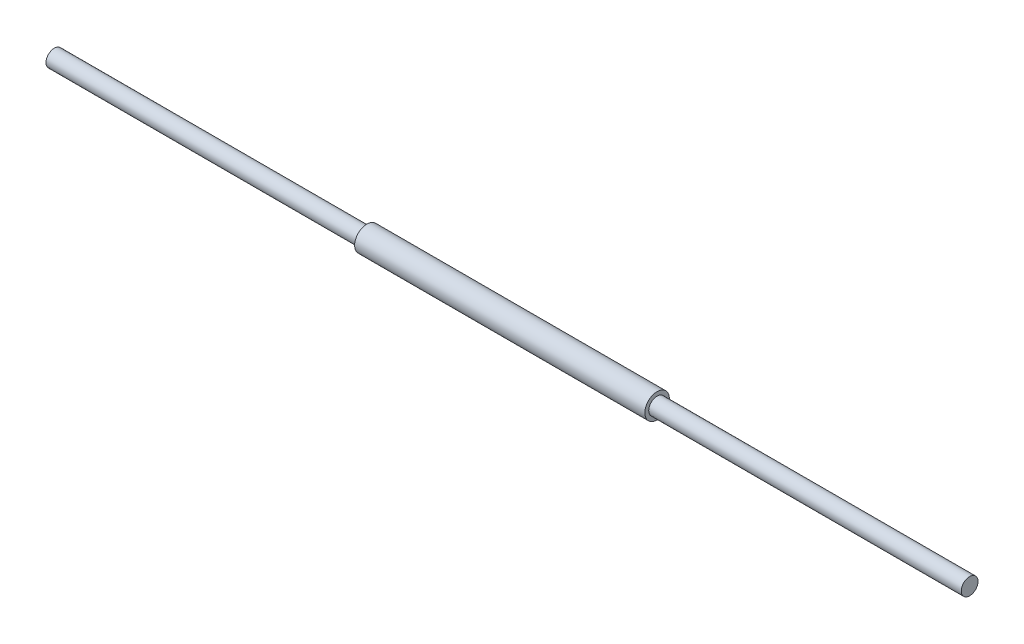
ISO-10303-21;
HEADER;
FILE_DESCRIPTION(('STEP AP214'),'2;1');
FILE_NAME('part.step','',(''),(''),'','','');
FILE_SCHEMA(('AUTOMOTIVE_DESIGN { 1 0 10303 214 1 1 1 1 }'));
ENDSEC;
DATA;
#1=APPLICATION_CONTEXT('core data for automotive mechanical design processes');
#2=APPLICATION_PROTOCOL_DEFINITION('international standard','automotive_design',2000,#1);
#3=PRODUCT_CONTEXT('',#1,'mechanical');
#4=PRODUCT('Part','Part','',(#3));
#5=PRODUCT_RELATED_PRODUCT_CATEGORY('part','',(#4));
#6=PRODUCT_DEFINITION_FORMATION('','',#4);
#7=PRODUCT_DEFINITION_CONTEXT('part definition',#1,'design');
#8=PRODUCT_DEFINITION('design','',#6,#7);
#9=PRODUCT_DEFINITION_SHAPE('','',#8);
#10=(LENGTH_UNIT() NAMED_UNIT(*) SI_UNIT(.MILLI.,.METRE.));
#11=(NAMED_UNIT(*) PLANE_ANGLE_UNIT() SI_UNIT($,.RADIAN.));
#12=(NAMED_UNIT(*) SI_UNIT($,.STERADIAN.) SOLID_ANGLE_UNIT());
#13=UNCERTAINTY_MEASURE_WITH_UNIT(LENGTH_MEASURE(1.E-05),#10,'distance_accuracy_value','');
#14=(GEOMETRIC_REPRESENTATION_CONTEXT(3) GLOBAL_UNCERTAINTY_ASSIGNED_CONTEXT((#13)) GLOBAL_UNIT_ASSIGNED_CONTEXT((#10,
#11,#12)) REPRESENTATION_CONTEXT('',''));
#15=CARTESIAN_POINT('',(0.,0.,0.));
#16=DIRECTION('',(0.,0.,1.));
#17=DIRECTION('',(1.,0.,0.));
#18=AXIS2_PLACEMENT_3D('',#15,#16,#17);
#19=CARTESIAN_POINT('',(-260.35,4.7625,0.));
#20=DIRECTION('',(1.,0.,0.));
#21=DIRECTION('',(0.,1.,0.));
#22=AXIS2_PLACEMENT_3D('',#19,#20,#21);
#23=PLANE('',#22);
#24=CARTESIAN_POINT('',(-260.35,0.,0.));
#25=DIRECTION('',(-1.,0.,0.));
#26=DIRECTION('',(0.,-1.,0.));
#27=AXIS2_PLACEMENT_3D('',#24,#25,#26);
#28=CIRCLE('',#27,4.76250000000003);
#29=CARTESIAN_POINT('',(-260.35,-4.76250000000007,0.));
#30=VERTEX_POINT('',#29);
#31=EDGE_CURVE('E10',#30,#30,#28,.T.);
#32=ORIENTED_EDGE('',*,*,#31,.T.);
#33=EDGE_LOOP('',(#32));
#34=FACE_BOUND('',#33,.T.);
#35=ADVANCED_FACE('F43',(#34),#23,.F.);
#36=CARTESIAN_POINT('',(-260.35,0.,0.));
#37=DIRECTION('',(-1.,0.,0.));
#38=DIRECTION('',(0.,-1.,0.));
#39=AXIS2_PLACEMENT_3D('',#36,#37,#38);
#40=CYLINDRICAL_SURFACE('',#39,4.76250000000002);
#41=ORIENTED_EDGE('',*,*,#31,.F.);
#42=EDGE_LOOP('',(#41));
#43=FACE_BOUND('',#42,.T.);
#44=CARTESIAN_POINT('',(-82.55,0.,0.));
#45=DIRECTION('',(-1.,0.,0.));
#46=DIRECTION('',(0.,-1.,0.));
#47=AXIS2_PLACEMENT_3D('',#44,#45,#46);
#48=CIRCLE('',#47,4.7625);
#49=CARTESIAN_POINT('',(-82.55,-4.7625,0.));
#50=VERTEX_POINT('',#49);
#51=EDGE_CURVE('E50',#50,#50,#48,.T.);
#52=ORIENTED_EDGE('',*,*,#51,.T.);
#53=EDGE_LOOP('',(#52));
#54=FACE_BOUND('',#53,.T.);
#55=ADVANCED_FACE('F87',(#43,#54),#40,.T.);
#56=CARTESIAN_POINT('',(-82.55,4.7625,0.));
#57=DIRECTION('',(1.,0.,0.));
#58=DIRECTION('',(0.,1.,0.));
#59=AXIS2_PLACEMENT_3D('',#56,#57,#58);
#60=PLANE('',#59);
#61=ORIENTED_EDGE('',*,*,#51,.F.);
#62=EDGE_LOOP('',(#61));
#63=FACE_BOUND('',#62,.T.);
#64=CARTESIAN_POINT('',(-82.55,0.,0.));
#65=DIRECTION('',(-1.,0.,0.));
#66=DIRECTION('',(0.,-1.,0.));
#67=AXIS2_PLACEMENT_3D('',#64,#65,#66);
#68=CIRCLE('',#67,6.98499999999996);
#69=CARTESIAN_POINT('',(-82.55,-6.98499999999996,0.));
#70=VERTEX_POINT('',#69);
#71=EDGE_CURVE('E55',#70,#70,#68,.T.);
#72=ORIENTED_EDGE('',*,*,#71,.T.);
#73=EDGE_LOOP('',(#72));
#74=FACE_BOUND('',#73,.T.);
#75=ADVANCED_FACE('F91',(#63,#74),#60,.F.);
#76=CARTESIAN_POINT('',(-260.35,0.,0.));
#77=DIRECTION('',(-1.,0.,0.));
#78=DIRECTION('',(0.,-1.,0.));
#79=AXIS2_PLACEMENT_3D('',#76,#77,#78);
#80=CYLINDRICAL_SURFACE('',#79,6.98499999999994);
#81=ORIENTED_EDGE('',*,*,#71,.F.);
#82=EDGE_LOOP('',(#81));
#83=FACE_BOUND('',#82,.T.);
#84=CARTESIAN_POINT('',(82.55,0.,0.));
#85=DIRECTION('',(-1.,0.,0.));
#86=DIRECTION('',(0.,-1.,0.));
#87=AXIS2_PLACEMENT_3D('',#84,#85,#86);
#88=CIRCLE('',#87,6.98499999999993);
#89=CARTESIAN_POINT('',(82.55,-6.9849999999999,0.));
#90=VERTEX_POINT('',#89);
#91=EDGE_CURVE('E60',#90,#90,#88,.T.);
#92=ORIENTED_EDGE('',*,*,#91,.T.);
#93=EDGE_LOOP('',(#92));
#94=FACE_BOUND('',#93,.T.);
#95=ADVANCED_FACE('F96',(#83,#94),#80,.T.);
#96=CARTESIAN_POINT('',(82.55,6.98499999999996,0.));
#97=DIRECTION('',(-1.,0.,0.));
#98=DIRECTION('',(0.,-1.,0.));
#99=AXIS2_PLACEMENT_3D('',#96,#97,#98);
#100=PLANE('',#99);
#101=ORIENTED_EDGE('',*,*,#91,.F.);
#102=EDGE_LOOP('',(#101));
#103=FACE_BOUND('',#102,.T.);
#104=CARTESIAN_POINT('',(82.55,0.,0.));
#105=DIRECTION('',(-1.,0.,0.));
#106=DIRECTION('',(0.,-1.,0.));
#107=AXIS2_PLACEMENT_3D('',#104,#105,#106);
#108=CIRCLE('',#107,4.76249999999997);
#109=CARTESIAN_POINT('',(82.55,-4.76249999999994,0.));
#110=VERTEX_POINT('',#109);
#111=EDGE_CURVE('E66',#110,#110,#108,.T.);
#112=ORIENTED_EDGE('',*,*,#111,.T.);
#113=EDGE_LOOP('',(#112));
#114=FACE_BOUND('',#113,.T.);
#115=ADVANCED_FACE('F83',(#103,#114),#100,.F.);
#116=CARTESIAN_POINT('',(-260.35,0.,0.));
#117=DIRECTION('',(-1.,0.,0.));
#118=DIRECTION('',(0.,-1.,0.));
#119=AXIS2_PLACEMENT_3D('',#116,#117,#118);
#120=CYLINDRICAL_SURFACE('',#119,4.7625);
#121=ORIENTED_EDGE('',*,*,#111,.F.);
#122=EDGE_LOOP('',(#121));
#123=FACE_BOUND('',#122,.T.);
#124=CARTESIAN_POINT('',(260.35,0.,0.));
#125=DIRECTION('',(-1.,0.,0.));
#126=DIRECTION('',(0.,-1.,0.));
#127=AXIS2_PLACEMENT_3D('',#124,#125,#126);
#128=CIRCLE('',#127,4.76250000000003);
#129=CARTESIAN_POINT('',(260.35,-4.76249999999997,0.));
#130=VERTEX_POINT('',#129);
#131=EDGE_CURVE('E70',#130,#130,#128,.T.);
#132=ORIENTED_EDGE('',*,*,#131,.T.);
#133=EDGE_LOOP('',(#132));
#134=FACE_BOUND('',#133,.T.);
#135=ADVANCED_FACE('F75',(#123,#134),#120,.T.);
#136=CARTESIAN_POINT('',(260.35,4.7625000000001,0.));
#137=DIRECTION('',(-1.,0.,0.));
#138=DIRECTION('',(0.,-1.,0.));
#139=AXIS2_PLACEMENT_3D('',#136,#137,#138);
#140=PLANE('',#139);
#141=ORIENTED_EDGE('',*,*,#131,.F.);
#142=EDGE_LOOP('',(#141));
#143=FACE_BOUND('',#142,.T.);
#144=ADVANCED_FACE('F77',(#143),#140,.F.);
#145=CLOSED_SHELL('',(#35,#55,#75,#95,#115,#135,#144));
#146=MANIFOLD_SOLID_BREP('B2',#145);
#147=ADVANCED_BREP_SHAPE_REPRESENTATION('',(#18,#146),#14);
#148=SHAPE_DEFINITION_REPRESENTATION(#9,#147);
ENDSEC;
END-ISO-10303-21;
